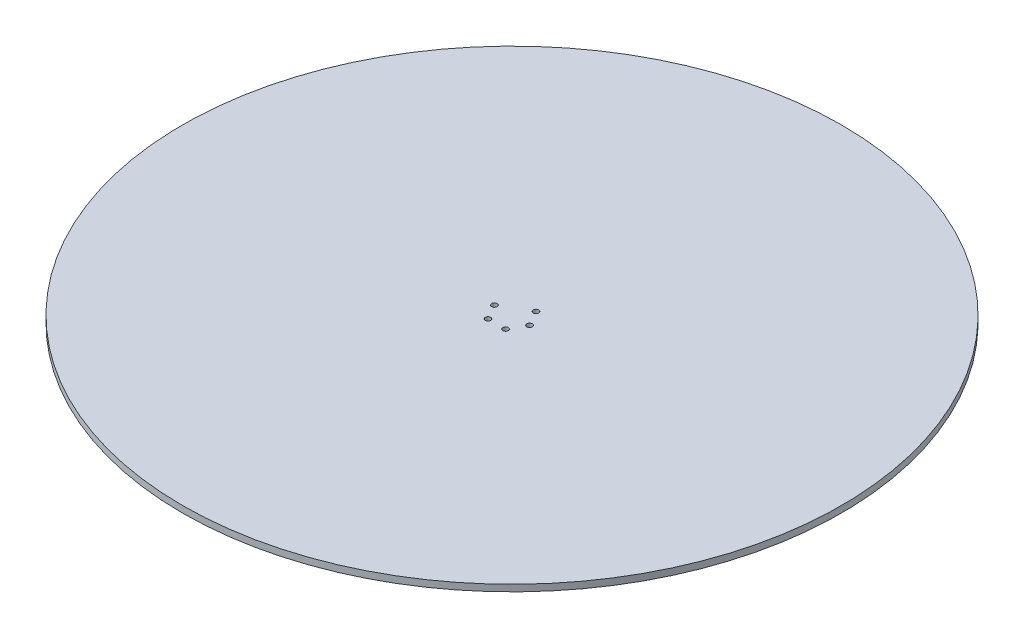
ISO-10303-21;
HEADER;
FILE_DESCRIPTION(('STEP AP214'),'2;1');
FILE_NAME('part.step','',(''),(''),'','','');
FILE_SCHEMA(('AUTOMOTIVE_DESIGN { 1 0 10303 214 1 1 1 1 }'));
ENDSEC;
DATA;
#1=APPLICATION_CONTEXT('core data for automotive mechanical design processes');
#2=APPLICATION_PROTOCOL_DEFINITION('international standard','automotive_design',2000,#1);
#3=PRODUCT_CONTEXT('',#1,'mechanical');
#4=PRODUCT('Part','Part','',(#3));
#5=PRODUCT_RELATED_PRODUCT_CATEGORY('part','',(#4));
#6=PRODUCT_DEFINITION_FORMATION('','',#4);
#7=PRODUCT_DEFINITION_CONTEXT('part definition',#1,'design');
#8=PRODUCT_DEFINITION('design','',#6,#7);
#9=PRODUCT_DEFINITION_SHAPE('','',#8);
#10=(LENGTH_UNIT() NAMED_UNIT(*) SI_UNIT(.MILLI.,.METRE.));
#11=(NAMED_UNIT(*) PLANE_ANGLE_UNIT() SI_UNIT($,.RADIAN.));
#12=(NAMED_UNIT(*) SI_UNIT($,.STERADIAN.) SOLID_ANGLE_UNIT());
#13=UNCERTAINTY_MEASURE_WITH_UNIT(LENGTH_MEASURE(1.E-05),#10,'distance_accuracy_value','');
#14=(GEOMETRIC_REPRESENTATION_CONTEXT(3) GLOBAL_UNCERTAINTY_ASSIGNED_CONTEXT((#13)) GLOBAL_UNIT_ASSIGNED_CONTEXT((#10,
#11,#12)) REPRESENTATION_CONTEXT('',''));
#15=CARTESIAN_POINT('',(0.,0.,0.));
#16=DIRECTION('',(0.,0.,1.));
#17=DIRECTION('',(1.,0.,0.));
#18=AXIS2_PLACEMENT_3D('',#15,#16,#17);
#19=CARTESIAN_POINT('',(0.,3.,0.));
#20=DIRECTION('',(0.,-1.,0.));
#21=DIRECTION('',(0.,0.,-1.));
#22=AXIS2_PLACEMENT_3D('',#19,#20,#21);
#23=CYLINDRICAL_SURFACE('',#22,150.);
#24=CARTESIAN_POINT('',(0.,3.,0.));
#25=DIRECTION('',(0.,1.,0.));
#26=DIRECTION('',(0.,0.,1.));
#27=AXIS2_PLACEMENT_3D('',#24,#25,#26);
#28=CIRCLE('',#27,150.);
#29=CARTESIAN_POINT('',(0.,3.,150.));
#30=VERTEX_POINT('',#29);
#31=EDGE_CURVE('E10',#30,#30,#28,.T.);
#32=ORIENTED_EDGE('',*,*,#31,.F.);
#33=EDGE_LOOP('',(#32));
#34=FACE_BOUND('',#33,.T.);
#35=CARTESIAN_POINT('',(0.,0.,0.));
#36=DIRECTION('',(0.,1.,0.));
#37=DIRECTION('',(0.,0.,1.));
#38=AXIS2_PLACEMENT_3D('',#35,#36,#37);
#39=CIRCLE('',#38,150.);
#40=CARTESIAN_POINT('',(0.,0.,150.));
#41=VERTEX_POINT('',#40);
#42=EDGE_CURVE('E37',#41,#41,#39,.T.);
#43=ORIENTED_EDGE('',*,*,#42,.T.);
#44=EDGE_LOOP('',(#43));
#45=FACE_BOUND('',#44,.T.);
#46=ADVANCED_FACE('F40',(#34,#45),#23,.T.);
#47=CARTESIAN_POINT('',(0.,3.,0.));
#48=DIRECTION('',(0.,1.,0.));
#49=DIRECTION('',(0.,0.,1.));
#50=AXIS2_PLACEMENT_3D('',#47,#48,#49);
#51=PLANE('',#50);
#52=CARTESIAN_POINT('',(8.,3.,0.));
#53=DIRECTION('',(0.,1.,0.));
#54=DIRECTION('',(0.,0.,1.));
#55=AXIS2_PLACEMENT_3D('',#52,#53,#54);
#56=CIRCLE('',#55,1.24999999999999);
#57=CARTESIAN_POINT('',(8.,3.,1.24999999999999));
#58=VERTEX_POINT('',#57);
#59=EDGE_CURVE('E50',#58,#58,#56,.T.);
#60=ORIENTED_EDGE('',*,*,#59,.F.);
#61=EDGE_LOOP('',(#60));
#62=FACE_BOUND('',#61,.T.);
#63=CARTESIAN_POINT('',(4.,3.,6.92820323027551));
#64=DIRECTION('',(0.,1.,0.));
#65=DIRECTION('',(0.,0.,1.));
#66=AXIS2_PLACEMENT_3D('',#63,#64,#65);
#67=CIRCLE('',#66,1.24999999999998);
#68=CARTESIAN_POINT('',(4.,3.,8.17820323027549));
#69=VERTEX_POINT('',#68);
#70=EDGE_CURVE('E51',#69,#69,#67,.T.);
#71=ORIENTED_EDGE('',*,*,#70,.F.);
#72=EDGE_LOOP('',(#71));
#73=FACE_BOUND('',#72,.T.);
#74=CARTESIAN_POINT('',(4.,3.,-6.92820323027551));
#75=DIRECTION('',(0.,1.,0.));
#76=DIRECTION('',(0.,0.,1.));
#77=AXIS2_PLACEMENT_3D('',#74,#75,#76);
#78=CIRCLE('',#77,1.24999999999999);
#79=CARTESIAN_POINT('',(4.,3.,-5.67820323027552));
#80=VERTEX_POINT('',#79);
#81=EDGE_CURVE('E53',#80,#80,#78,.T.);
#82=ORIENTED_EDGE('',*,*,#81,.F.);
#83=EDGE_LOOP('',(#82));
#84=FACE_BOUND('',#83,.T.);
#85=CARTESIAN_POINT('',(-4.,3.,6.92820323027551));
#86=DIRECTION('',(0.,1.,0.));
#87=DIRECTION('',(0.,0.,1.));
#88=AXIS2_PLACEMENT_3D('',#85,#86,#87);
#89=CIRCLE('',#88,1.24999999999999);
#90=CARTESIAN_POINT('',(-4.,3.,8.17820323027549));
#91=VERTEX_POINT('',#90);
#92=EDGE_CURVE('E60',#91,#91,#89,.T.);
#93=ORIENTED_EDGE('',*,*,#92,.F.);
#94=EDGE_LOOP('',(#93));
#95=FACE_BOUND('',#94,.T.);
#96=CARTESIAN_POINT('',(-8.,3.,0.));
#97=DIRECTION('',(0.,1.,0.));
#98=DIRECTION('',(0.,0.,1.));
#99=AXIS2_PLACEMENT_3D('',#96,#97,#98);
#100=CIRCLE('',#99,1.24999999999999);
#101=CARTESIAN_POINT('',(-8.,3.,1.24999999999998));
#102=VERTEX_POINT('',#101);
#103=EDGE_CURVE('E58',#102,#102,#100,.T.);
#104=ORIENTED_EDGE('',*,*,#103,.F.);
#105=EDGE_LOOP('',(#104));
#106=FACE_BOUND('',#105,.T.);
#107=ORIENTED_EDGE('',*,*,#31,.T.);
#108=EDGE_LOOP('',(#107));
#109=FACE_BOUND('',#108,.T.);
#110=ADVANCED_FACE('F85',(#62,#73,#84,#95,#106,#109),#51,.T.);
#111=CARTESIAN_POINT('',(0.,0.,0.));
#112=DIRECTION('',(0.,1.,0.));
#113=DIRECTION('',(0.,0.,1.));
#114=AXIS2_PLACEMENT_3D('',#111,#112,#113);
#115=PLANE('',#114);
#116=CARTESIAN_POINT('',(8.,0.,0.));
#117=DIRECTION('',(0.,-1.,0.));
#118=DIRECTION('',(0.,0.,-1.));
#119=AXIS2_PLACEMENT_3D('',#116,#117,#118);
#120=CIRCLE('',#119,1.24999999999999);
#121=CARTESIAN_POINT('',(8.,0.,-1.24999999999999));
#122=VERTEX_POINT('',#121);
#123=EDGE_CURVE('E64',#122,#122,#120,.T.);
#124=ORIENTED_EDGE('',*,*,#123,.F.);
#125=EDGE_LOOP('',(#124));
#126=FACE_BOUND('',#125,.T.);
#127=CARTESIAN_POINT('',(4.,0.,6.92820323027551));
#128=DIRECTION('',(0.,-1.,0.));
#129=DIRECTION('',(0.,0.,-1.));
#130=AXIS2_PLACEMENT_3D('',#127,#128,#129);
#131=CIRCLE('',#130,1.24999999999998);
#132=CARTESIAN_POINT('',(4.,0.,5.67820323027552));
#133=VERTEX_POINT('',#132);
#134=EDGE_CURVE('E71',#133,#133,#131,.T.);
#135=ORIENTED_EDGE('',*,*,#134,.F.);
#136=EDGE_LOOP('',(#135));
#137=FACE_BOUND('',#136,.T.);
#138=CARTESIAN_POINT('',(4.,0.,-6.92820323027551));
#139=DIRECTION('',(0.,-1.,0.));
#140=DIRECTION('',(0.,0.,-1.));
#141=AXIS2_PLACEMENT_3D('',#138,#139,#140);
#142=CIRCLE('',#141,1.24999999999999);
#143=CARTESIAN_POINT('',(4.,0.,-8.17820323027549));
#144=VERTEX_POINT('',#143);
#145=EDGE_CURVE('E70',#144,#144,#142,.T.);
#146=ORIENTED_EDGE('',*,*,#145,.F.);
#147=EDGE_LOOP('',(#146));
#148=FACE_BOUND('',#147,.T.);
#149=CARTESIAN_POINT('',(-4.,0.,6.92820323027551));
#150=DIRECTION('',(0.,-1.,0.));
#151=DIRECTION('',(0.,0.,-1.));
#152=AXIS2_PLACEMENT_3D('',#149,#150,#151);
#153=CIRCLE('',#152,1.24999999999999);
#154=CARTESIAN_POINT('',(-4.,0.,5.67820323027552));
#155=VERTEX_POINT('',#154);
#156=EDGE_CURVE('E67',#155,#155,#153,.T.);
#157=ORIENTED_EDGE('',*,*,#156,.F.);
#158=EDGE_LOOP('',(#157));
#159=FACE_BOUND('',#158,.T.);
#160=CARTESIAN_POINT('',(-8.,0.,0.));
#161=DIRECTION('',(0.,-1.,0.));
#162=DIRECTION('',(0.,0.,-1.));
#163=AXIS2_PLACEMENT_3D('',#160,#161,#162);
#164=CIRCLE('',#163,1.24999999999999);
#165=CARTESIAN_POINT('',(-8.,0.,-1.24999999999999));
#166=VERTEX_POINT('',#165);
#167=EDGE_CURVE('E61',#166,#166,#164,.T.);
#168=ORIENTED_EDGE('',*,*,#167,.F.);
#169=EDGE_LOOP('',(#168));
#170=FACE_BOUND('',#169,.T.);
#171=ORIENTED_EDGE('',*,*,#42,.F.);
#172=EDGE_LOOP('',(#171));
#173=FACE_BOUND('',#172,.T.);
#174=ADVANCED_FACE('F81',(#126,#137,#148,#159,#170,#173),#115,.F.);
#175=CARTESIAN_POINT('',(-8.,10.,0.));
#176=DIRECTION('',(0.,-1.,0.));
#177=DIRECTION('',(0.,0.,-1.));
#178=AXIS2_PLACEMENT_3D('',#175,#176,#177);
#179=CYLINDRICAL_SURFACE('',#178,1.24999999999999);
#180=ORIENTED_EDGE('',*,*,#103,.T.);
#181=EDGE_LOOP('',(#180));
#182=FACE_BOUND('',#181,.T.);
#183=ORIENTED_EDGE('',*,*,#167,.T.);
#184=EDGE_LOOP('',(#183));
#185=FACE_BOUND('',#184,.T.);
#186=ADVANCED_FACE('F83',(#182,#185),#179,.F.);
#187=CARTESIAN_POINT('',(-4.,10.,6.92820323027551));
#188=DIRECTION('',(0.,-1.,0.));
#189=DIRECTION('',(0.,0.,-1.));
#190=AXIS2_PLACEMENT_3D('',#187,#188,#189);
#191=CYLINDRICAL_SURFACE('',#190,1.24999999999999);
#192=ORIENTED_EDGE('',*,*,#92,.T.);
#193=EDGE_LOOP('',(#192));
#194=FACE_BOUND('',#193,.T.);
#195=ORIENTED_EDGE('',*,*,#156,.T.);
#196=EDGE_LOOP('',(#195));
#197=FACE_BOUND('',#196,.T.);
#198=ADVANCED_FACE('F109',(#194,#197),#191,.F.);
#199=CARTESIAN_POINT('',(4.,10.,-6.92820323027551));
#200=DIRECTION('',(0.,-1.,0.));
#201=DIRECTION('',(0.,0.,-1.));
#202=AXIS2_PLACEMENT_3D('',#199,#200,#201);
#203=CYLINDRICAL_SURFACE('',#202,1.24999999999999);
#204=ORIENTED_EDGE('',*,*,#81,.T.);
#205=EDGE_LOOP('',(#204));
#206=FACE_BOUND('',#205,.T.);
#207=ORIENTED_EDGE('',*,*,#145,.T.);
#208=EDGE_LOOP('',(#207));
#209=FACE_BOUND('',#208,.T.);
#210=ADVANCED_FACE('F111',(#206,#209),#203,.F.);
#211=CARTESIAN_POINT('',(4.,10.,6.92820323027551));
#212=DIRECTION('',(0.,-1.,0.));
#213=DIRECTION('',(0.,0.,-1.));
#214=AXIS2_PLACEMENT_3D('',#211,#212,#213);
#215=CYLINDRICAL_SURFACE('',#214,1.24999999999998);
#216=ORIENTED_EDGE('',*,*,#70,.T.);
#217=EDGE_LOOP('',(#216));
#218=FACE_BOUND('',#217,.T.);
#219=ORIENTED_EDGE('',*,*,#134,.T.);
#220=EDGE_LOOP('',(#219));
#221=FACE_BOUND('',#220,.T.);
#222=ADVANCED_FACE('F119',(#218,#221),#215,.F.);
#223=CARTESIAN_POINT('',(8.,10.,0.));
#224=DIRECTION('',(0.,-1.,0.));
#225=DIRECTION('',(0.,0.,-1.));
#226=AXIS2_PLACEMENT_3D('',#223,#224,#225);
#227=CYLINDRICAL_SURFACE('',#226,1.24999999999999);
#228=ORIENTED_EDGE('',*,*,#59,.T.);
#229=EDGE_LOOP('',(#228));
#230=FACE_BOUND('',#229,.T.);
#231=ORIENTED_EDGE('',*,*,#123,.T.);
#232=EDGE_LOOP('',(#231));
#233=FACE_BOUND('',#232,.T.);
#234=ADVANCED_FACE('F76',(#230,#233),#227,.F.);
#235=CLOSED_SHELL('',(#46,#110,#174,#186,#198,#210,#222,#234));
#236=MANIFOLD_SOLID_BREP('B2',#235);
#237=ADVANCED_BREP_SHAPE_REPRESENTATION('',(#18,#236),#14);
#238=SHAPE_DEFINITION_REPRESENTATION(#9,#237);
ENDSEC;
END-ISO-10303-21;
